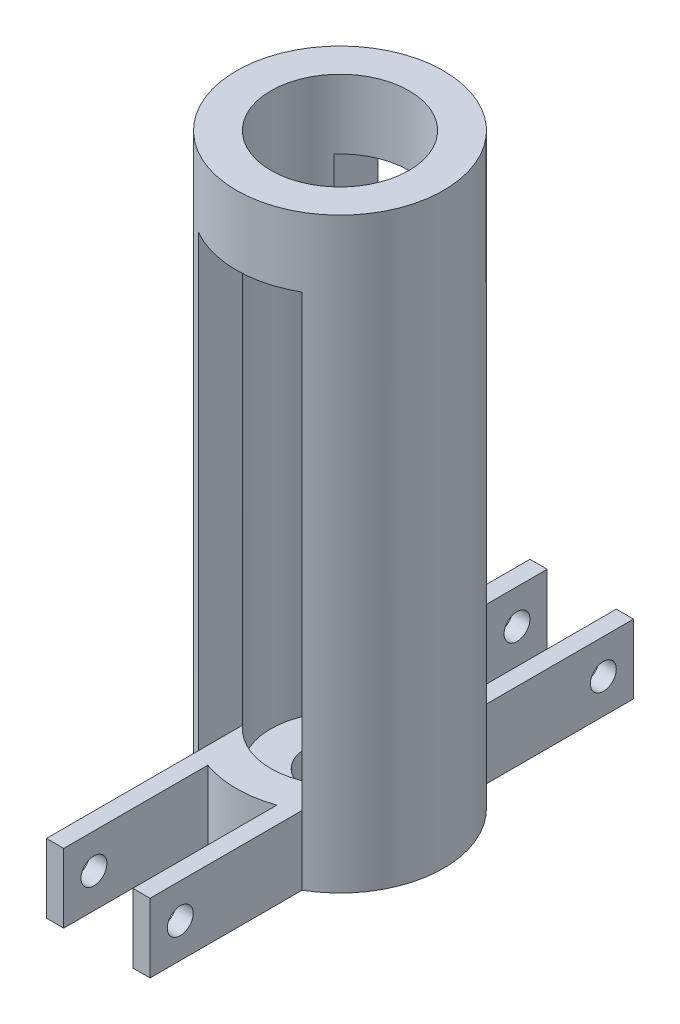
ISO-10303-21;
HEADER;
FILE_DESCRIPTION(('STEP AP214'),'2;1');
FILE_NAME('part.step','',(''),(''),'','','');
FILE_SCHEMA(('AUTOMOTIVE_DESIGN { 1 0 10303 214 1 1 1 1 }'));
ENDSEC;
DATA;
#1=APPLICATION_CONTEXT('core data for automotive mechanical design processes');
#2=APPLICATION_PROTOCOL_DEFINITION('international standard','automotive_design',2000,#1);
#3=PRODUCT_CONTEXT('',#1,'mechanical');
#4=PRODUCT('Part','Part','',(#3));
#5=PRODUCT_RELATED_PRODUCT_CATEGORY('part','',(#4));
#6=PRODUCT_DEFINITION_FORMATION('','',#4);
#7=PRODUCT_DEFINITION_CONTEXT('part definition',#1,'design');
#8=PRODUCT_DEFINITION('design','',#6,#7);
#9=PRODUCT_DEFINITION_SHAPE('','',#8);
#10=(LENGTH_UNIT() NAMED_UNIT(*) SI_UNIT(.MILLI.,.METRE.));
#11=(NAMED_UNIT(*) PLANE_ANGLE_UNIT() SI_UNIT($,.RADIAN.));
#12=(NAMED_UNIT(*) SI_UNIT($,.STERADIAN.) SOLID_ANGLE_UNIT());
#13=UNCERTAINTY_MEASURE_WITH_UNIT(LENGTH_MEASURE(1.E-05),#10,'distance_accuracy_value','');
#14=(GEOMETRIC_REPRESENTATION_CONTEXT(3) GLOBAL_UNCERTAINTY_ASSIGNED_CONTEXT((#13)) GLOBAL_UNIT_ASSIGNED_CONTEXT((#10,
#11,#12)) REPRESENTATION_CONTEXT('',''));
#15=CARTESIAN_POINT('',(0.,0.,0.));
#16=DIRECTION('',(0.,0.,1.));
#17=DIRECTION('',(1.,0.,0.));
#18=AXIS2_PLACEMENT_3D('',#15,#16,#17);
#19=CARTESIAN_POINT('',(0.,107.95,0.));
#20=DIRECTION('',(0.,-1.,0.));
#21=DIRECTION('',(0.,0.,-1.));
#22=AXIS2_PLACEMENT_3D('',#19,#20,#21);
#23=CYLINDRICAL_SURFACE('',#22,19.05);
#24=CARTESIAN_POINT('',(0.,107.95,0.));
#25=DIRECTION('',(0.,1.,0.));
#26=DIRECTION('',(0.,0.,1.));
#27=AXIS2_PLACEMENT_3D('',#24,#25,#26);
#28=CIRCLE('',#27,19.05);
#29=CARTESIAN_POINT('',(0.,107.95,19.05));
#30=VERTEX_POINT('',#29);
#31=EDGE_CURVE('E344',#30,#30,#28,.T.);
#32=ORIENTED_EDGE('',*,*,#31,.F.);
#33=EDGE_LOOP('',(#32));
#34=FACE_BOUND('',#33,.T.);
#35=DIRECTION('',(0.,-1.,0.));
#36=VECTOR('',#35,1.);
#37=CARTESIAN_POINT('',(-9.52500000000001,107.95,-16.4977839420935));
#38=LINE('',#37,#36);
#39=CARTESIAN_POINT('',(-9.52500000000001,12.7,-16.4977839420935));
#40=VERTEX_POINT('',#39);
#41=CARTESIAN_POINT('',(-9.52500000000001,95.25,-16.4977839420935));
#42=VERTEX_POINT('',#41);
#43=EDGE_CURVE('E44',#40,#42,#38,.F.);
#44=ORIENTED_EDGE('',*,*,#43,.F.);
#45=DIRECTION('',(0.,1.,0.));
#46=VECTOR('',#45,1.);
#47=CARTESIAN_POINT('',(-9.52500000000001,0.,-16.4977839420936));
#48=LINE('',#47,#46);
#49=CARTESIAN_POINT('',(-9.52500000000001,0.,-16.4977839420936));
#50=VERTEX_POINT('',#49);
#51=EDGE_CURVE('E220',#50,#40,#48,.T.);
#52=ORIENTED_EDGE('',*,*,#51,.F.);
#53=CARTESIAN_POINT('',(0.,0.,0.));
#54=DIRECTION('',(0.,1.,0.));
#55=DIRECTION('',(0.,0.,1.));
#56=AXIS2_PLACEMENT_3D('',#53,#54,#55);
#57=CIRCLE('',#56,19.05);
#58=CARTESIAN_POINT('',(-9.525,0.,16.4977839420936));
#59=VERTEX_POINT('',#58);
#60=EDGE_CURVE('E343',#50,#59,#57,.T.);
#61=ORIENTED_EDGE('',*,*,#60,.T.);
#62=DIRECTION('',(0.,1.,0.));
#63=VECTOR('',#62,1.);
#64=CARTESIAN_POINT('',(-9.525,0.,16.4977839420936));
#65=LINE('',#64,#63);
#66=CARTESIAN_POINT('',(-9.525,12.7,16.4977839420936));
#67=VERTEX_POINT('',#66);
#68=EDGE_CURVE('E289',#59,#67,#65,.T.);
#69=ORIENTED_EDGE('',*,*,#68,.T.);
#70=DIRECTION('',(0.,-1.,0.));
#71=VECTOR('',#70,1.);
#72=CARTESIAN_POINT('',(-9.52500000000001,107.95,16.4977839420935));
#73=LINE('',#72,#71);
#74=CARTESIAN_POINT('',(-9.52500000000001,95.25,16.4977839420935));
#75=VERTEX_POINT('',#74);
#76=EDGE_CURVE('E360',#75,#67,#73,.T.);
#77=ORIENTED_EDGE('',*,*,#76,.F.);
#78=CARTESIAN_POINT('',(0.,95.25,0.));
#79=DIRECTION('',(0.,1.,0.));
#80=DIRECTION('',(0.,0.,1.));
#81=AXIS2_PLACEMENT_3D('',#78,#79,#80);
#82=CIRCLE('',#81,19.05);
#83=CARTESIAN_POINT('',(9.52499999999999,95.25,16.4977839420936));
#84=VERTEX_POINT('',#83);
#85=EDGE_CURVE('E358',#75,#84,#82,.T.);
#86=ORIENTED_EDGE('',*,*,#85,.T.);
#87=DIRECTION('',(0.,-1.,0.));
#88=VECTOR('',#87,1.);
#89=CARTESIAN_POINT('',(9.52499999999998,107.95,16.4977839420936));
#90=LINE('',#89,#88);
#91=CARTESIAN_POINT('',(9.52500000000001,12.7,16.4977839420935));
#92=VERTEX_POINT('',#91);
#93=EDGE_CURVE('E355',#84,#92,#90,.T.);
#94=ORIENTED_EDGE('',*,*,#93,.T.);
#95=DIRECTION('',(0.,1.,0.));
#96=VECTOR('',#95,1.);
#97=CARTESIAN_POINT('',(9.525,0.,16.4977839420936));
#98=LINE('',#97,#96);
#99=CARTESIAN_POINT('',(9.525,0.,16.4977839420936));
#100=VERTEX_POINT('',#99);
#101=EDGE_CURVE('E265',#100,#92,#98,.T.);
#102=ORIENTED_EDGE('',*,*,#101,.F.);
#103=CARTESIAN_POINT('',(9.525,0.,-16.4977839420936));
#104=VERTEX_POINT('',#103);
#105=EDGE_CURVE('E351',#100,#104,#57,.T.);
#106=ORIENTED_EDGE('',*,*,#105,.T.);
#107=DIRECTION('',(0.,1.,0.));
#108=VECTOR('',#107,1.);
#109=CARTESIAN_POINT('',(9.525,0.,-16.4977839420936));
#110=LINE('',#109,#108);
#111=CARTESIAN_POINT('',(9.525,12.7,-16.4977839420936));
#112=VERTEX_POINT('',#111);
#113=EDGE_CURVE('E240',#104,#112,#110,.T.);
#114=ORIENTED_EDGE('',*,*,#113,.T.);
#115=DIRECTION('',(0.,-1.,0.));
#116=VECTOR('',#115,1.);
#117=CARTESIAN_POINT('',(9.52499999999998,107.95,-16.4977839420936));
#118=LINE('',#117,#116);
#119=CARTESIAN_POINT('',(9.52499999999999,95.25,-16.4977839420936));
#120=VERTEX_POINT('',#119);
#121=EDGE_CURVE('E11',#112,#120,#118,.F.);
#122=ORIENTED_EDGE('',*,*,#121,.T.);
#123=EDGE_CURVE('E361',#120,#42,#82,.T.);
#124=ORIENTED_EDGE('',*,*,#123,.T.);
#125=EDGE_LOOP('',(#44,#52,#61,#69,#77,#86,#94,#102,#106,#114,#122,#124));
#126=FACE_BOUND('',#125,.T.);
#127=ADVANCED_FACE('F35',(#34,#126),#23,.T.);
#128=CARTESIAN_POINT('',(-6.35,0.,17.9605122421383));
#129=VERTEX_POINT('',#128);
#130=CARTESIAN_POINT('',(6.35,0.,17.9605122421383));
#131=VERTEX_POINT('',#130);
#132=EDGE_CURVE('E348',#129,#131,#57,.T.);
#133=ORIENTED_EDGE('',*,*,#132,.T.);
#134=DIRECTION('',(0.,-1.,0.));
#135=VECTOR('',#134,1.);
#136=CARTESIAN_POINT('',(6.35,107.95,17.9605122421383));
#137=LINE('',#136,#135);
#138=CARTESIAN_POINT('',(6.35,12.7,17.9605122421383));
#139=VERTEX_POINT('',#138);
#140=EDGE_CURVE('E268',#131,#139,#137,.F.);
#141=ORIENTED_EDGE('',*,*,#140,.T.);
#142=CARTESIAN_POINT('',(0.,12.7,0.));
#143=DIRECTION('',(0.,1.,0.));
#144=DIRECTION('',(-1.,0.,0.));
#145=AXIS2_PLACEMENT_3D('',#142,#143,#144);
#146=CIRCLE('',#145,19.05);
#147=CARTESIAN_POINT('',(-6.35,12.7,17.9605122421383));
#148=VERTEX_POINT('',#147);
#149=EDGE_CURVE('E347',#148,#139,#146,.T.);
#150=ORIENTED_EDGE('',*,*,#149,.F.);
#151=DIRECTION('',(0.,-1.,0.));
#152=VECTOR('',#151,1.);
#153=CARTESIAN_POINT('',(-6.35,107.95,17.9605122421383));
#154=LINE('',#153,#152);
#155=EDGE_CURVE('E292',#148,#129,#154,.T.);
#156=ORIENTED_EDGE('',*,*,#155,.T.);
#157=EDGE_LOOP('',(#133,#141,#150,#156));
#158=FACE_BOUND('',#157,.T.);
#159=ADVANCED_FACE('F419',(#158),#23,.T.);
#160=CARTESIAN_POINT('',(0.,107.95,0.));
#161=DIRECTION('',(0.,-1.,0.));
#162=DIRECTION('',(0.,0.,-1.));
#163=AXIS2_PLACEMENT_3D('',#160,#161,#162);
#164=CYLINDRICAL_SURFACE('',#163,12.7);
#165=CARTESIAN_POINT('',(0.,107.95,0.));
#166=DIRECTION('',(0.,1.,0.));
#167=DIRECTION('',(0.,0.,1.));
#168=AXIS2_PLACEMENT_3D('',#165,#166,#167);
#169=CIRCLE('',#168,12.7);
#170=CARTESIAN_POINT('',(0.,107.95,12.7));
#171=VERTEX_POINT('',#170);
#172=EDGE_CURVE('E340',#171,#171,#169,.T.);
#173=ORIENTED_EDGE('',*,*,#172,.T.);
#174=EDGE_LOOP('',(#173));
#175=FACE_BOUND('',#174,.T.);
#176=CARTESIAN_POINT('',(0.,6.34999999999999,0.));
#177=DIRECTION('',(0.,-1.,0.));
#178=DIRECTION('',(0.,0.,-1.));
#179=AXIS2_PLACEMENT_3D('',#176,#177,#178);
#180=CIRCLE('',#179,12.7);
#181=CARTESIAN_POINT('',(0.,6.34999999999999,-12.7));
#182=VERTEX_POINT('',#181);
#183=EDGE_CURVE('E339',#182,#182,#180,.T.);
#184=ORIENTED_EDGE('',*,*,#183,.T.);
#185=EDGE_LOOP('',(#184));
#186=FACE_BOUND('',#185,.T.);
#187=CARTESIAN_POINT('',(0.,12.7,0.));
#188=DIRECTION('',(0.,1.,0.));
#189=DIRECTION('',(-1.,0.,0.));
#190=AXIS2_PLACEMENT_3D('',#187,#188,#189);
#191=CIRCLE('',#190,12.7);
#192=CARTESIAN_POINT('',(9.52500000000001,12.7,-8.40026041263006));
#193=VERTEX_POINT('',#192);
#194=CARTESIAN_POINT('',(-9.52500000000001,12.7,-8.40026041263006));
#195=VERTEX_POINT('',#194);
#196=EDGE_CURVE('E321',#193,#195,#191,.T.);
#197=ORIENTED_EDGE('',*,*,#196,.T.);
#198=DIRECTION('',(0.,-1.,0.));
#199=VECTOR('',#198,1.);
#200=CARTESIAN_POINT('',(-9.52500000000001,107.95,-8.40026041263006));
#201=LINE('',#200,#199);
#202=CARTESIAN_POINT('',(-9.52500000000001,95.25,-8.40026041263006));
#203=VERTEX_POINT('',#202);
#204=EDGE_CURVE('E333',#195,#203,#201,.F.);
#205=ORIENTED_EDGE('',*,*,#204,.T.);
#206=CARTESIAN_POINT('',(0.,95.25,0.));
#207=DIRECTION('',(0.,1.,0.));
#208=DIRECTION('',(0.,0.,1.));
#209=AXIS2_PLACEMENT_3D('',#206,#207,#208);
#210=CIRCLE('',#209,12.7);
#211=CARTESIAN_POINT('',(9.52499999999999,95.25,-8.4002604126301));
#212=VERTEX_POINT('',#211);
#213=EDGE_CURVE('E332',#212,#203,#210,.T.);
#214=ORIENTED_EDGE('',*,*,#213,.F.);
#215=DIRECTION('',(0.,-1.,0.));
#216=VECTOR('',#215,1.);
#217=CARTESIAN_POINT('',(9.52499999999998,107.95,-8.40026041263009));
#218=LINE('',#217,#216);
#219=EDGE_CURVE('E325',#193,#212,#218,.F.);
#220=ORIENTED_EDGE('',*,*,#219,.F.);
#221=EDGE_LOOP('',(#197,#205,#214,#220));
#222=FACE_BOUND('',#221,.T.);
#223=CARTESIAN_POINT('',(-9.52500000000001,95.25,8.40026041263006));
#224=VERTEX_POINT('',#223);
#225=CARTESIAN_POINT('',(9.52499999999999,95.25,8.40026041263009));
#226=VERTEX_POINT('',#225);
#227=EDGE_CURVE('E330',#224,#226,#210,.T.);
#228=ORIENTED_EDGE('',*,*,#227,.F.);
#229=DIRECTION('',(0.,-1.,0.));
#230=VECTOR('',#229,1.);
#231=CARTESIAN_POINT('',(-9.52500000000001,107.95,8.40026041263006));
#232=LINE('',#231,#230);
#233=CARTESIAN_POINT('',(-9.52500000000001,12.7,8.40026041263006));
#234=VERTEX_POINT('',#233);
#235=EDGE_CURVE('E336',#224,#234,#232,.T.);
#236=ORIENTED_EDGE('',*,*,#235,.T.);
#237=CARTESIAN_POINT('',(9.52500000000001,12.7,8.40026041263006));
#238=VERTEX_POINT('',#237);
#239=EDGE_CURVE('E324',#234,#238,#191,.T.);
#240=ORIENTED_EDGE('',*,*,#239,.T.);
#241=DIRECTION('',(0.,-1.,0.));
#242=VECTOR('',#241,1.);
#243=CARTESIAN_POINT('',(9.52499999999998,107.95,8.40026041263009));
#244=LINE('',#243,#242);
#245=EDGE_CURVE('E327',#226,#238,#244,.T.);
#246=ORIENTED_EDGE('',*,*,#245,.F.);
#247=EDGE_LOOP('',(#228,#236,#240,#246));
#248=FACE_BOUND('',#247,.T.);
#249=ADVANCED_FACE('F384',(#175,#186,#222,#248),#164,.F.);
#250=CARTESIAN_POINT('',(6.35,0.,-17.9605122421383));
#251=VERTEX_POINT('',#250);
#252=CARTESIAN_POINT('',(-6.35000000000001,0.,-17.9605122421383));
#253=VERTEX_POINT('',#252);
#254=EDGE_CURVE('E398',#251,#253,#57,.T.);
#255=ORIENTED_EDGE('',*,*,#254,.T.);
#256=DIRECTION('',(0.,-1.,0.));
#257=VECTOR('',#256,1.);
#258=CARTESIAN_POINT('',(-6.35000000000001,107.95,-17.9605122421383));
#259=LINE('',#258,#257);
#260=CARTESIAN_POINT('',(-6.35000000000001,12.7,-17.9605122421383));
#261=VERTEX_POINT('',#260);
#262=EDGE_CURVE('E223',#253,#261,#259,.F.);
#263=ORIENTED_EDGE('',*,*,#262,.T.);
#264=CARTESIAN_POINT('',(6.35,12.7,-17.9605122421383));
#265=VERTEX_POINT('',#264);
#266=EDGE_CURVE('E194',#265,#261,#146,.T.);
#267=ORIENTED_EDGE('',*,*,#266,.F.);
#268=DIRECTION('',(0.,-1.,0.));
#269=VECTOR('',#268,1.);
#270=CARTESIAN_POINT('',(6.35,107.95,-17.9605122421383));
#271=LINE('',#270,#269);
#272=EDGE_CURVE('E243',#265,#251,#271,.T.);
#273=ORIENTED_EDGE('',*,*,#272,.T.);
#274=EDGE_LOOP('',(#255,#263,#267,#273));
#275=FACE_BOUND('',#274,.T.);
#276=ADVANCED_FACE('F37',(#275),#23,.T.);
#277=CARTESIAN_POINT('',(0.,107.95,0.));
#278=DIRECTION('',(0.,1.,0.));
#279=DIRECTION('',(0.,0.,1.));
#280=AXIS2_PLACEMENT_3D('',#277,#278,#279);
#281=PLANE('',#280);
#282=ORIENTED_EDGE('',*,*,#31,.T.);
#283=EDGE_LOOP('',(#282));
#284=FACE_BOUND('',#283,.T.);
#285=ORIENTED_EDGE('',*,*,#172,.F.);
#286=EDGE_LOOP('',(#285));
#287=FACE_BOUND('',#286,.T.);
#288=ADVANCED_FACE('F418',(#284,#287),#281,.T.);
#289=CARTESIAN_POINT('',(0.,0.,0.));
#290=DIRECTION('',(0.,1.,0.));
#291=DIRECTION('',(0.,0.,1.));
#292=AXIS2_PLACEMENT_3D('',#289,#290,#291);
#293=PLANE('',#292);
#294=ORIENTED_EDGE('',*,*,#60,.F.);
#295=DIRECTION('',(0.,0.,1.));
#296=VECTOR('',#295,1.);
#297=CARTESIAN_POINT('',(-9.52500000000001,0.,-16.4977839420936));
#298=LINE('',#297,#296);
#299=CARTESIAN_POINT('',(-9.52500000000002,0.,-44.45));
#300=VERTEX_POINT('',#299);
#301=EDGE_CURVE('E208',#300,#50,#298,.T.);
#302=ORIENTED_EDGE('',*,*,#301,.F.);
#303=DIRECTION('',(-1.,0.,0.));
#304=VECTOR('',#303,1.);
#305=CARTESIAN_POINT('',(-6.35000000000002,0.,-44.45));
#306=LINE('',#305,#304);
#307=CARTESIAN_POINT('',(-6.35000000000002,0.,-44.45));
#308=VERTEX_POINT('',#307);
#309=EDGE_CURVE('E217',#308,#300,#306,.T.);
#310=ORIENTED_EDGE('',*,*,#309,.F.);
#311=DIRECTION('',(0.,0.,-1.));
#312=VECTOR('',#311,1.);
#313=CARTESIAN_POINT('',(-6.35000000000001,0.,-16.4977839420936));
#314=LINE('',#313,#312);
#315=EDGE_CURVE('E203',#253,#308,#314,.T.);
#316=ORIENTED_EDGE('',*,*,#315,.F.);
#317=ORIENTED_EDGE('',*,*,#254,.F.);
#318=DIRECTION('',(0.,0.,1.));
#319=VECTOR('',#318,1.);
#320=CARTESIAN_POINT('',(6.35,0.,-16.4977839420936));
#321=LINE('',#320,#319);
#322=CARTESIAN_POINT('',(6.35,0.,-44.45));
#323=VERTEX_POINT('',#322);
#324=EDGE_CURVE('E238',#323,#251,#321,.T.);
#325=ORIENTED_EDGE('',*,*,#324,.F.);
#326=DIRECTION('',(-1.,0.,0.));
#327=VECTOR('',#326,1.);
#328=CARTESIAN_POINT('',(6.35,0.,-44.45));
#329=LINE('',#328,#327);
#330=CARTESIAN_POINT('',(9.525,0.,-44.45));
#331=VERTEX_POINT('',#330);
#332=EDGE_CURVE('E235',#331,#323,#329,.T.);
#333=ORIENTED_EDGE('',*,*,#332,.F.);
#334=DIRECTION('',(0.,0.,-1.));
#335=VECTOR('',#334,1.);
#336=CARTESIAN_POINT('',(9.525,0.,-16.4977839420936));
#337=LINE('',#336,#335);
#338=EDGE_CURVE('E232',#104,#331,#337,.T.);
#339=ORIENTED_EDGE('',*,*,#338,.F.);
#340=ORIENTED_EDGE('',*,*,#105,.F.);
#341=DIRECTION('',(0.,0.,-1.));
#342=VECTOR('',#341,1.);
#343=CARTESIAN_POINT('',(9.525,0.,16.4977839420936));
#344=LINE('',#343,#342);
#345=CARTESIAN_POINT('',(9.525,0.,44.45));
#346=VERTEX_POINT('',#345);
#347=EDGE_CURVE('E262',#346,#100,#344,.T.);
#348=ORIENTED_EDGE('',*,*,#347,.F.);
#349=DIRECTION('',(1.,0.,0.));
#350=VECTOR('',#349,1.);
#351=CARTESIAN_POINT('',(6.35,0.,44.45));
#352=LINE('',#351,#350);
#353=CARTESIAN_POINT('',(6.35,0.,44.45));
#354=VERTEX_POINT('',#353);
#355=EDGE_CURVE('E259',#354,#346,#352,.T.);
#356=ORIENTED_EDGE('',*,*,#355,.F.);
#357=DIRECTION('',(0.,0.,1.));
#358=VECTOR('',#357,1.);
#359=CARTESIAN_POINT('',(6.35,0.,16.4977839420936));
#360=LINE('',#359,#358);
#361=EDGE_CURVE('E257',#131,#354,#360,.T.);
#362=ORIENTED_EDGE('',*,*,#361,.F.);
#363=ORIENTED_EDGE('',*,*,#132,.F.);
#364=DIRECTION('',(0.,0.,-1.));
#365=VECTOR('',#364,1.);
#366=CARTESIAN_POINT('',(-6.35,0.,16.4977839420936));
#367=LINE('',#366,#365);
#368=CARTESIAN_POINT('',(-6.35,0.,44.45));
#369=VERTEX_POINT('',#368);
#370=EDGE_CURVE('E287',#369,#129,#367,.T.);
#371=ORIENTED_EDGE('',*,*,#370,.F.);
#372=DIRECTION('',(1.,0.,0.));
#373=VECTOR('',#372,1.);
#374=CARTESIAN_POINT('',(-6.35,0.,44.45));
#375=LINE('',#374,#373);
#376=CARTESIAN_POINT('',(-9.525,0.,44.45));
#377=VERTEX_POINT('',#376);
#378=EDGE_CURVE('E284',#377,#369,#375,.T.);
#379=ORIENTED_EDGE('',*,*,#378,.F.);
#380=DIRECTION('',(0.,0.,1.));
#381=VECTOR('',#380,1.);
#382=CARTESIAN_POINT('',(-9.525,0.,16.4977839420936));
#383=LINE('',#382,#381);
#384=EDGE_CURVE('E281',#59,#377,#383,.T.);
#385=ORIENTED_EDGE('',*,*,#384,.F.);
#386=EDGE_LOOP('',(#294,#302,#310,#316,#317,#325,#333,#339,#340,#348,#356,#362,#363,#371,#379,#385));
#387=FACE_BOUND('',#386,.T.);
#388=CARTESIAN_POINT('',(0.,0.,0.));
#389=DIRECTION('',(0.,1.,0.));
#390=DIRECTION('',(0.,0.,1.));
#391=AXIS2_PLACEMENT_3D('',#388,#389,#390);
#392=CIRCLE('',#391,6.35);
#393=CARTESIAN_POINT('',(0.,0.,6.35));
#394=VERTEX_POINT('',#393);
#395=EDGE_CURVE('E300',#394,#394,#392,.T.);
#396=ORIENTED_EDGE('',*,*,#395,.T.);
#397=EDGE_LOOP('',(#396));
#398=FACE_BOUND('',#397,.T.);
#399=ADVANCED_FACE('F395',(#387,#398),#293,.F.);
#400=CARTESIAN_POINT('',(0.,6.35,0.));
#401=DIRECTION('',(0.,-1.,0.));
#402=DIRECTION('',(0.,0.,-1.));
#403=AXIS2_PLACEMENT_3D('',#400,#401,#402);
#404=PLANE('',#403);
#405=CARTESIAN_POINT('',(0.,6.35,0.));
#406=DIRECTION('',(0.,1.,0.));
#407=DIRECTION('',(0.,0.,1.));
#408=AXIS2_PLACEMENT_3D('',#405,#406,#407);
#409=CIRCLE('',#408,6.35);
#410=CARTESIAN_POINT('',(0.,6.35,6.35));
#411=VERTEX_POINT('',#410);
#412=EDGE_CURVE('E299',#411,#411,#409,.T.);
#413=ORIENTED_EDGE('',*,*,#412,.F.);
#414=EDGE_LOOP('',(#413));
#415=FACE_BOUND('',#414,.T.);
#416=ORIENTED_EDGE('',*,*,#183,.F.);
#417=EDGE_LOOP('',(#416));
#418=FACE_BOUND('',#417,.T.);
#419=ADVANCED_FACE('F495',(#415,#418),#404,.F.);
#420=CARTESIAN_POINT('',(0.,12.7,-19.05));
#421=DIRECTION('',(0.,1.,0.));
#422=DIRECTION('',(-1.,0.,0.));
#423=AXIS2_PLACEMENT_3D('',#420,#421,#422);
#424=PLANE('',#423);
#425=ORIENTED_EDGE('',*,*,#266,.T.);
#426=DIRECTION('',(0.,0.,-1.));
#427=VECTOR('',#426,1.);
#428=CARTESIAN_POINT('',(-6.35000000000001,12.7,-16.4977839420936));
#429=LINE('',#428,#427);
#430=CARTESIAN_POINT('',(-6.35000000000002,12.7,-44.45));
#431=VERTEX_POINT('',#430);
#432=EDGE_CURVE('E187',#261,#431,#429,.T.);
#433=ORIENTED_EDGE('',*,*,#432,.T.);
#434=DIRECTION('',(-1.,0.,0.));
#435=VECTOR('',#434,1.);
#436=CARTESIAN_POINT('',(-6.35000000000002,12.7,-44.45));
#437=LINE('',#436,#435);
#438=CARTESIAN_POINT('',(-9.52500000000002,12.7,-44.45));
#439=VERTEX_POINT('',#438);
#440=EDGE_CURVE('E191',#431,#439,#437,.T.);
#441=ORIENTED_EDGE('',*,*,#440,.T.);
#442=DIRECTION('',(0.,0.,1.));
#443=VECTOR('',#442,1.);
#444=CARTESIAN_POINT('',(-9.52500000000001,12.7,-16.4977839420936));
#445=LINE('',#444,#443);
#446=EDGE_CURVE('E211',#439,#40,#445,.T.);
#447=ORIENTED_EDGE('',*,*,#446,.T.);
#448=DIRECTION('',(0.,0.,1.));
#449=VECTOR('',#448,1.);
#450=CARTESIAN_POINT('',(-9.52500000000001,12.7,-19.05));
#451=LINE('',#450,#449);
#452=EDGE_CURVE('E318',#40,#195,#451,.T.);
#453=ORIENTED_EDGE('',*,*,#452,.T.);
#454=ORIENTED_EDGE('',*,*,#196,.F.);
#455=DIRECTION('',(0.,0.,1.));
#456=VECTOR('',#455,1.);
#457=CARTESIAN_POINT('',(9.52500000000001,12.7,-19.05));
#458=LINE('',#457,#456);
#459=EDGE_CURVE('E314',#112,#193,#458,.T.);
#460=ORIENTED_EDGE('',*,*,#459,.F.);
#461=DIRECTION('',(0.,0.,-1.));
#462=VECTOR('',#461,1.);
#463=CARTESIAN_POINT('',(9.525,12.7,-16.4977839420936));
#464=LINE('',#463,#462);
#465=CARTESIAN_POINT('',(9.525,12.7,-44.45));
#466=VERTEX_POINT('',#465);
#467=EDGE_CURVE('E226',#112,#466,#464,.T.);
#468=ORIENTED_EDGE('',*,*,#467,.T.);
#469=DIRECTION('',(-1.,0.,0.));
#470=VECTOR('',#469,1.);
#471=CARTESIAN_POINT('',(6.35,12.7,-44.45));
#472=LINE('',#471,#470);
#473=CARTESIAN_POINT('',(6.35,12.7,-44.45));
#474=VERTEX_POINT('',#473);
#475=EDGE_CURVE('E229',#466,#474,#472,.T.);
#476=ORIENTED_EDGE('',*,*,#475,.T.);
#477=DIRECTION('',(0.,0.,1.));
#478=VECTOR('',#477,1.);
#479=CARTESIAN_POINT('',(6.35,12.7,-16.4977839420936));
#480=LINE('',#479,#478);
#481=EDGE_CURVE('E51',#474,#265,#480,.T.);
#482=ORIENTED_EDGE('',*,*,#481,.T.);
#483=EDGE_LOOP('',(#425,#433,#441,#447,#453,#454,#460,#468,#476,#482));
#484=FACE_BOUND('',#483,.T.);
#485=ADVANCED_FACE('F189',(#484),#424,.T.);
#486=CARTESIAN_POINT('',(9.52500000000001,0.,-19.05));
#487=DIRECTION('',(1.,0.,0.));
#488=DIRECTION('',(0.,1.,0.));
#489=AXIS2_PLACEMENT_3D('',#486,#487,#488);
#490=PLANE('',#489);
#491=ORIENTED_EDGE('',*,*,#219,.T.);
#492=DIRECTION('',(0.,0.,1.));
#493=VECTOR('',#492,1.);
#494=CARTESIAN_POINT('',(9.52499999999999,95.25,-19.05));
#495=LINE('',#494,#493);
#496=EDGE_CURVE('E310',#120,#212,#495,.T.);
#497=ORIENTED_EDGE('',*,*,#496,.F.);
#498=ORIENTED_EDGE('',*,*,#121,.F.);
#499=ORIENTED_EDGE('',*,*,#459,.T.);
#500=EDGE_LOOP('',(#491,#497,#498,#499));
#501=FACE_BOUND('',#500,.T.);
#502=ADVANCED_FACE('F379',(#501),#490,.F.);
#503=CARTESIAN_POINT('',(0.,95.25,-19.05));
#504=DIRECTION('',(0.,1.,0.));
#505=DIRECTION('',(0.,0.,1.));
#506=AXIS2_PLACEMENT_3D('',#503,#504,#505);
#507=PLANE('',#506);
#508=ORIENTED_EDGE('',*,*,#213,.T.);
#509=DIRECTION('',(0.,0.,1.));
#510=VECTOR('',#509,1.);
#511=CARTESIAN_POINT('',(-9.52500000000001,95.25,-19.05));
#512=LINE('',#511,#510);
#513=EDGE_CURVE('E309',#42,#203,#512,.T.);
#514=ORIENTED_EDGE('',*,*,#513,.F.);
#515=ORIENTED_EDGE('',*,*,#123,.F.);
#516=ORIENTED_EDGE('',*,*,#496,.T.);
#517=EDGE_LOOP('',(#508,#514,#515,#516));
#518=FACE_BOUND('',#517,.T.);
#519=ADVANCED_FACE('F376',(#518),#507,.F.);
#520=CARTESIAN_POINT('',(-9.52500000000001,0.,-19.05));
#521=DIRECTION('',(1.,0.,0.));
#522=DIRECTION('',(0.,0.,-1.));
#523=AXIS2_PLACEMENT_3D('',#520,#521,#522);
#524=PLANE('',#523);
#525=ORIENTED_EDGE('',*,*,#452,.F.);
#526=ORIENTED_EDGE('',*,*,#43,.T.);
#527=ORIENTED_EDGE('',*,*,#513,.T.);
#528=ORIENTED_EDGE('',*,*,#204,.F.);
#529=EDGE_LOOP('',(#525,#526,#527,#528));
#530=FACE_BOUND('',#529,.T.);
#531=ADVANCED_FACE('F387',(#530),#524,.T.);
#532=EDGE_CURVE('E306',#224,#75,#512,.T.);
#533=ORIENTED_EDGE('',*,*,#532,.T.);
#534=ORIENTED_EDGE('',*,*,#76,.T.);
#535=EDGE_CURVE('E303',#234,#67,#451,.T.);
#536=ORIENTED_EDGE('',*,*,#535,.F.);
#537=ORIENTED_EDGE('',*,*,#235,.F.);
#538=EDGE_LOOP('',(#533,#534,#536,#537));
#539=FACE_BOUND('',#538,.T.);
#540=ADVANCED_FACE('F460',(#539),#524,.T.);
#541=ORIENTED_EDGE('',*,*,#227,.T.);
#542=EDGE_CURVE('E311',#226,#84,#495,.T.);
#543=ORIENTED_EDGE('',*,*,#542,.T.);
#544=ORIENTED_EDGE('',*,*,#85,.F.);
#545=ORIENTED_EDGE('',*,*,#532,.F.);
#546=EDGE_LOOP('',(#541,#543,#544,#545));
#547=FACE_BOUND('',#546,.T.);
#548=ADVANCED_FACE('F457',(#547),#507,.F.);
#549=ORIENTED_EDGE('',*,*,#245,.T.);
#550=EDGE_CURVE('E315',#238,#92,#458,.T.);
#551=ORIENTED_EDGE('',*,*,#550,.T.);
#552=ORIENTED_EDGE('',*,*,#93,.F.);
#553=ORIENTED_EDGE('',*,*,#542,.F.);
#554=EDGE_LOOP('',(#549,#551,#552,#553));
#555=FACE_BOUND('',#554,.T.);
#556=ADVANCED_FACE('F450',(#555),#490,.F.);
#557=ORIENTED_EDGE('',*,*,#149,.T.);
#558=DIRECTION('',(0.,0.,1.));
#559=VECTOR('',#558,1.);
#560=CARTESIAN_POINT('',(6.35,12.7,16.4977839420936));
#561=LINE('',#560,#559);
#562=CARTESIAN_POINT('',(6.35,12.7,44.45));
#563=VERTEX_POINT('',#562);
#564=EDGE_CURVE('E250',#139,#563,#561,.T.);
#565=ORIENTED_EDGE('',*,*,#564,.T.);
#566=DIRECTION('',(1.,0.,0.));
#567=VECTOR('',#566,1.);
#568=CARTESIAN_POINT('',(6.35,12.7,44.45));
#569=LINE('',#568,#567);
#570=CARTESIAN_POINT('',(9.525,12.7,44.45));
#571=VERTEX_POINT('',#570);
#572=EDGE_CURVE('E252',#563,#571,#569,.T.);
#573=ORIENTED_EDGE('',*,*,#572,.T.);
#574=DIRECTION('',(0.,0.,-1.));
#575=VECTOR('',#574,1.);
#576=CARTESIAN_POINT('',(9.525,12.7,16.4977839420936));
#577=LINE('',#576,#575);
#578=EDGE_CURVE('E255',#571,#92,#577,.T.);
#579=ORIENTED_EDGE('',*,*,#578,.T.);
#580=ORIENTED_EDGE('',*,*,#550,.F.);
#581=ORIENTED_EDGE('',*,*,#239,.F.);
#582=ORIENTED_EDGE('',*,*,#535,.T.);
#583=DIRECTION('',(0.,0.,1.));
#584=VECTOR('',#583,1.);
#585=CARTESIAN_POINT('',(-9.525,12.7,16.4977839420936));
#586=LINE('',#585,#584);
#587=CARTESIAN_POINT('',(-9.525,12.7,44.45));
#588=VERTEX_POINT('',#587);
#589=EDGE_CURVE('E275',#67,#588,#586,.T.);
#590=ORIENTED_EDGE('',*,*,#589,.T.);
#591=DIRECTION('',(1.,0.,0.));
#592=VECTOR('',#591,1.);
#593=CARTESIAN_POINT('',(-6.35,12.7,44.45));
#594=LINE('',#593,#592);
#595=CARTESIAN_POINT('',(-6.35,12.7,44.45));
#596=VERTEX_POINT('',#595);
#597=EDGE_CURVE('E278',#588,#596,#594,.T.);
#598=ORIENTED_EDGE('',*,*,#597,.T.);
#599=DIRECTION('',(0.,0.,-1.));
#600=VECTOR('',#599,1.);
#601=CARTESIAN_POINT('',(-6.35,12.7,16.4977839420936));
#602=LINE('',#601,#600);
#603=EDGE_CURVE('E59',#596,#148,#602,.T.);
#604=ORIENTED_EDGE('',*,*,#603,.T.);
#605=EDGE_LOOP('',(#557,#565,#573,#579,#580,#581,#582,#590,#598,#604));
#606=FACE_BOUND('',#605,.T.);
#607=ADVANCED_FACE('F445',(#606),#424,.T.);
#608=CARTESIAN_POINT('',(0.,0.,0.));
#609=DIRECTION('',(0.,1.,0.));
#610=DIRECTION('',(0.,0.,1.));
#611=AXIS2_PLACEMENT_3D('',#608,#609,#610);
#612=CYLINDRICAL_SURFACE('',#611,6.35);
#613=ORIENTED_EDGE('',*,*,#395,.F.);
#614=EDGE_LOOP('',(#613));
#615=FACE_BOUND('',#614,.T.);
#616=ORIENTED_EDGE('',*,*,#412,.T.);
#617=EDGE_LOOP('',(#616));
#618=FACE_BOUND('',#617,.T.);
#619=ADVANCED_FACE('F469',(#615,#618),#612,.F.);
#620=CARTESIAN_POINT('',(-6.35,0.,16.4977839420936));
#621=DIRECTION('',(1.,0.,0.));
#622=DIRECTION('',(0.,0.,-1.));
#623=AXIS2_PLACEMENT_3D('',#620,#621,#622);
#624=PLANE('',#623);
#625=CARTESIAN_POINT('',(-6.35,6.35,38.89375));
#626=DIRECTION('',(1.,0.,0.));
#627=DIRECTION('',(0.,0.,-1.));
#628=AXIS2_PLACEMENT_3D('',#625,#626,#627);
#629=CIRCLE('',#628,2.38125);
#630=CARTESIAN_POINT('',(-6.35,6.35,36.5125));
#631=VERTEX_POINT('',#630);
#632=EDGE_CURVE('E197',#631,#631,#629,.T.);
#633=ORIENTED_EDGE('',*,*,#632,.F.);
#634=EDGE_LOOP('',(#633));
#635=FACE_BOUND('',#634,.T.);
#636=ORIENTED_EDGE('',*,*,#155,.F.);
#637=ORIENTED_EDGE('',*,*,#603,.F.);
#638=DIRECTION('',(0.,1.,0.));
#639=VECTOR('',#638,1.);
#640=CARTESIAN_POINT('',(-6.35,0.,44.45));
#641=LINE('',#640,#639);
#642=EDGE_CURVE('E290',#369,#596,#641,.T.);
#643=ORIENTED_EDGE('',*,*,#642,.F.);
#644=ORIENTED_EDGE('',*,*,#370,.T.);
#645=EDGE_LOOP('',(#636,#637,#643,#644));
#646=FACE_BOUND('',#645,.T.);
#647=ADVANCED_FACE('F467',(#635,#646),#624,.T.);
#648=CARTESIAN_POINT('',(-6.35,0.,44.45));
#649=DIRECTION('',(0.,0.,1.));
#650=DIRECTION('',(1.,0.,0.));
#651=AXIS2_PLACEMENT_3D('',#648,#649,#650);
#652=PLANE('',#651);
#653=ORIENTED_EDGE('',*,*,#642,.T.);
#654=ORIENTED_EDGE('',*,*,#597,.F.);
#655=DIRECTION('',(0.,1.,0.));
#656=VECTOR('',#655,1.);
#657=CARTESIAN_POINT('',(-9.525,0.,44.45));
#658=LINE('',#657,#656);
#659=EDGE_CURVE('E293',#377,#588,#658,.T.);
#660=ORIENTED_EDGE('',*,*,#659,.F.);
#661=ORIENTED_EDGE('',*,*,#378,.T.);
#662=EDGE_LOOP('',(#653,#654,#660,#661));
#663=FACE_BOUND('',#662,.T.);
#664=ADVANCED_FACE('F465',(#663),#652,.T.);
#665=CARTESIAN_POINT('',(-9.525,0.,16.4977839420936));
#666=DIRECTION('',(-1.,0.,0.));
#667=DIRECTION('',(0.,0.,1.));
#668=AXIS2_PLACEMENT_3D('',#665,#666,#667);
#669=PLANE('',#668);
#670=CARTESIAN_POINT('',(-9.52500000000001,6.35,38.89375));
#671=DIRECTION('',(-1.,0.,0.));
#672=DIRECTION('',(0.,0.,-1.));
#673=AXIS2_PLACEMENT_3D('',#670,#671,#672);
#674=CIRCLE('',#673,2.38125);
#675=CARTESIAN_POINT('',(-9.52500000000001,6.35,36.5125));
#676=VERTEX_POINT('',#675);
#677=EDGE_CURVE('E736',#676,#676,#674,.T.);
#678=ORIENTED_EDGE('',*,*,#677,.F.);
#679=EDGE_LOOP('',(#678));
#680=FACE_BOUND('',#679,.T.);
#681=ORIENTED_EDGE('',*,*,#659,.T.);
#682=ORIENTED_EDGE('',*,*,#589,.F.);
#683=ORIENTED_EDGE('',*,*,#68,.F.);
#684=ORIENTED_EDGE('',*,*,#384,.T.);
#685=EDGE_LOOP('',(#681,#682,#683,#684));
#686=FACE_BOUND('',#685,.T.);
#687=ADVANCED_FACE('F476',(#680,#686),#669,.T.);
#688=CARTESIAN_POINT('',(6.35,0.,16.4977839420936));
#689=DIRECTION('',(-1.,0.,0.));
#690=DIRECTION('',(0.,0.,1.));
#691=AXIS2_PLACEMENT_3D('',#688,#689,#690);
#692=PLANE('',#691);
#693=CARTESIAN_POINT('',(6.35,6.35,38.89375));
#694=DIRECTION('',(-1.,0.,0.));
#695=DIRECTION('',(0.,0.,1.));
#696=AXIS2_PLACEMENT_3D('',#693,#694,#695);
#697=CIRCLE('',#696,2.38125);
#698=CARTESIAN_POINT('',(6.35,6.35,41.275));
#699=VERTEX_POINT('',#698);
#700=EDGE_CURVE('E751',#699,#699,#697,.T.);
#701=ORIENTED_EDGE('',*,*,#700,.F.);
#702=EDGE_LOOP('',(#701));
#703=FACE_BOUND('',#702,.T.);
#704=ORIENTED_EDGE('',*,*,#140,.F.);
#705=ORIENTED_EDGE('',*,*,#361,.T.);
#706=DIRECTION('',(0.,1.,0.));
#707=VECTOR('',#706,1.);
#708=CARTESIAN_POINT('',(6.35,0.,44.45));
#709=LINE('',#708,#707);
#710=EDGE_CURVE('E264',#354,#563,#709,.T.);
#711=ORIENTED_EDGE('',*,*,#710,.T.);
#712=ORIENTED_EDGE('',*,*,#564,.F.);
#713=EDGE_LOOP('',(#704,#705,#711,#712));
#714=FACE_BOUND('',#713,.T.);
#715=ADVANCED_FACE('F440',(#703,#714),#692,.T.);
#716=CARTESIAN_POINT('',(9.525,0.,16.4977839420936));
#717=DIRECTION('',(1.,0.,0.));
#718=DIRECTION('',(0.,0.,-1.));
#719=AXIS2_PLACEMENT_3D('',#716,#717,#718);
#720=PLANE('',#719);
#721=CARTESIAN_POINT('',(9.525,6.35,38.89375));
#722=DIRECTION('',(1.,0.,0.));
#723=DIRECTION('',(0.,0.,-1.));
#724=AXIS2_PLACEMENT_3D('',#721,#722,#723);
#725=CIRCLE('',#724,2.38125);
#726=CARTESIAN_POINT('',(9.525,6.35,36.5125));
#727=VERTEX_POINT('',#726);
#728=EDGE_CURVE('E39',#727,#727,#725,.T.);
#729=ORIENTED_EDGE('',*,*,#728,.F.);
#730=EDGE_LOOP('',(#729));
#731=FACE_BOUND('',#730,.T.);
#732=ORIENTED_EDGE('',*,*,#101,.T.);
#733=ORIENTED_EDGE('',*,*,#578,.F.);
#734=DIRECTION('',(0.,1.,0.));
#735=VECTOR('',#734,1.);
#736=CARTESIAN_POINT('',(9.525,0.,44.45));
#737=LINE('',#736,#735);
#738=EDGE_CURVE('E269',#346,#571,#737,.T.);
#739=ORIENTED_EDGE('',*,*,#738,.F.);
#740=ORIENTED_EDGE('',*,*,#347,.T.);
#741=EDGE_LOOP('',(#732,#733,#739,#740));
#742=FACE_BOUND('',#741,.T.);
#743=ADVANCED_FACE('F447',(#731,#742),#720,.T.);
#744=CARTESIAN_POINT('',(6.35,0.,44.45));
#745=DIRECTION('',(0.,0.,1.));
#746=DIRECTION('',(1.,0.,0.));
#747=AXIS2_PLACEMENT_3D('',#744,#745,#746);
#748=PLANE('',#747);
#749=ORIENTED_EDGE('',*,*,#738,.T.);
#750=ORIENTED_EDGE('',*,*,#572,.F.);
#751=ORIENTED_EDGE('',*,*,#710,.F.);
#752=ORIENTED_EDGE('',*,*,#355,.T.);
#753=EDGE_LOOP('',(#749,#750,#751,#752));
#754=FACE_BOUND('',#753,.T.);
#755=ADVANCED_FACE('F443',(#754),#748,.T.);
#756=CARTESIAN_POINT('',(6.35,0.,-16.4977839420936));
#757=DIRECTION('',(-1.,0.,0.));
#758=DIRECTION('',(0.,0.,1.));
#759=AXIS2_PLACEMENT_3D('',#756,#757,#758);
#760=PLANE('',#759);
#761=CARTESIAN_POINT('',(6.35,6.35,-38.89375));
#762=DIRECTION('',(-1.,0.,0.));
#763=DIRECTION('',(0.,0.,1.));
#764=AXIS2_PLACEMENT_3D('',#761,#762,#763);
#765=CIRCLE('',#764,2.38125);
#766=CARTESIAN_POINT('',(6.35,6.35,-36.5125));
#767=VERTEX_POINT('',#766);
#768=EDGE_CURVE('E748',#767,#767,#765,.T.);
#769=ORIENTED_EDGE('',*,*,#768,.F.);
#770=EDGE_LOOP('',(#769));
#771=FACE_BOUND('',#770,.T.);
#772=ORIENTED_EDGE('',*,*,#272,.F.);
#773=ORIENTED_EDGE('',*,*,#481,.F.);
#774=DIRECTION('',(0.,1.,0.));
#775=VECTOR('',#774,1.);
#776=CARTESIAN_POINT('',(6.35,0.,-44.45));
#777=LINE('',#776,#775);
#778=EDGE_CURVE('E241',#323,#474,#777,.T.);
#779=ORIENTED_EDGE('',*,*,#778,.F.);
#780=ORIENTED_EDGE('',*,*,#324,.T.);
#781=EDGE_LOOP('',(#772,#773,#779,#780));
#782=FACE_BOUND('',#781,.T.);
#783=ADVANCED_FACE('F416',(#771,#782),#760,.T.);
#784=CARTESIAN_POINT('',(6.35,0.,-44.45));
#785=DIRECTION('',(0.,0.,-1.));
#786=DIRECTION('',(-1.,0.,0.));
#787=AXIS2_PLACEMENT_3D('',#784,#785,#786);
#788=PLANE('',#787);
#789=ORIENTED_EDGE('',*,*,#778,.T.);
#790=ORIENTED_EDGE('',*,*,#475,.F.);
#791=DIRECTION('',(0.,1.,0.));
#792=VECTOR('',#791,1.);
#793=CARTESIAN_POINT('',(9.525,0.,-44.45));
#794=LINE('',#793,#792);
#795=EDGE_CURVE('E244',#331,#466,#794,.T.);
#796=ORIENTED_EDGE('',*,*,#795,.F.);
#797=ORIENTED_EDGE('',*,*,#332,.T.);
#798=EDGE_LOOP('',(#789,#790,#796,#797));
#799=FACE_BOUND('',#798,.T.);
#800=ADVANCED_FACE('F414',(#799),#788,.T.);
#801=CARTESIAN_POINT('',(9.525,0.,-16.4977839420936));
#802=DIRECTION('',(1.,0.,0.));
#803=DIRECTION('',(0.,0.,-1.));
#804=AXIS2_PLACEMENT_3D('',#801,#802,#803);
#805=PLANE('',#804);
#806=CARTESIAN_POINT('',(9.525,6.35,-38.89375));
#807=DIRECTION('',(1.,0.,0.));
#808=DIRECTION('',(0.,0.,-1.));
#809=AXIS2_PLACEMENT_3D('',#806,#807,#808);
#810=CIRCLE('',#809,2.38125);
#811=CARTESIAN_POINT('',(9.525,6.35,-41.275));
#812=VERTEX_POINT('',#811);
#813=EDGE_CURVE('E745',#812,#812,#810,.T.);
#814=ORIENTED_EDGE('',*,*,#813,.F.);
#815=EDGE_LOOP('',(#814));
#816=FACE_BOUND('',#815,.T.);
#817=ORIENTED_EDGE('',*,*,#795,.T.);
#818=ORIENTED_EDGE('',*,*,#467,.F.);
#819=ORIENTED_EDGE('',*,*,#113,.F.);
#820=ORIENTED_EDGE('',*,*,#338,.T.);
#821=EDGE_LOOP('',(#817,#818,#819,#820));
#822=FACE_BOUND('',#821,.T.);
#823=ADVANCED_FACE('F411',(#816,#822),#805,.T.);
#824=CARTESIAN_POINT('',(-6.35000000000001,0.,-16.4977839420936));
#825=DIRECTION('',(1.,0.,0.));
#826=DIRECTION('',(0.,0.,-1.));
#827=AXIS2_PLACEMENT_3D('',#824,#825,#826);
#828=PLANE('',#827);
#829=CARTESIAN_POINT('',(-6.35000000000002,6.35,-38.89375));
#830=DIRECTION('',(1.,0.,0.));
#831=DIRECTION('',(0.,0.,-1.));
#832=AXIS2_PLACEMENT_3D('',#829,#830,#831);
#833=CIRCLE('',#832,2.38125);
#834=CARTESIAN_POINT('',(-6.35000000000002,6.35,-41.275));
#835=VERTEX_POINT('',#834);
#836=EDGE_CURVE('E740',#835,#835,#833,.T.);
#837=ORIENTED_EDGE('',*,*,#836,.F.);
#838=EDGE_LOOP('',(#837));
#839=FACE_BOUND('',#838,.T.);
#840=ORIENTED_EDGE('',*,*,#262,.F.);
#841=ORIENTED_EDGE('',*,*,#315,.T.);
#842=DIRECTION('',(0.,1.,0.));
#843=VECTOR('',#842,1.);
#844=CARTESIAN_POINT('',(-6.35000000000002,0.,-44.45));
#845=LINE('',#844,#843);
#846=EDGE_CURVE('E200',#308,#431,#845,.T.);
#847=ORIENTED_EDGE('',*,*,#846,.T.);
#848=ORIENTED_EDGE('',*,*,#432,.F.);
#849=EDGE_LOOP('',(#840,#841,#847,#848));
#850=FACE_BOUND('',#849,.T.);
#851=ADVANCED_FACE('F201',(#839,#850),#828,.T.);
#852=CARTESIAN_POINT('',(-9.52500000000001,0.,-16.4977839420936));
#853=DIRECTION('',(-1.,0.,0.));
#854=DIRECTION('',(0.,0.,1.));
#855=AXIS2_PLACEMENT_3D('',#852,#853,#854);
#856=PLANE('',#855);
#857=CARTESIAN_POINT('',(-9.525,6.35,-38.89375));
#858=DIRECTION('',(-1.,0.,0.));
#859=DIRECTION('',(0.,0.,1.));
#860=AXIS2_PLACEMENT_3D('',#857,#858,#859);
#861=CIRCLE('',#860,2.38125);
#862=CARTESIAN_POINT('',(-9.525,6.35,-36.5125));
#863=VERTEX_POINT('',#862);
#864=EDGE_CURVE('E737',#863,#863,#861,.T.);
#865=ORIENTED_EDGE('',*,*,#864,.F.);
#866=EDGE_LOOP('',(#865));
#867=FACE_BOUND('',#866,.T.);
#868=ORIENTED_EDGE('',*,*,#51,.T.);
#869=ORIENTED_EDGE('',*,*,#446,.F.);
#870=DIRECTION('',(0.,1.,0.));
#871=VECTOR('',#870,1.);
#872=CARTESIAN_POINT('',(-9.52500000000002,0.,-44.45));
#873=LINE('',#872,#871);
#874=EDGE_CURVE('E207',#300,#439,#873,.T.);
#875=ORIENTED_EDGE('',*,*,#874,.F.);
#876=ORIENTED_EDGE('',*,*,#301,.T.);
#877=EDGE_LOOP('',(#868,#869,#875,#876));
#878=FACE_BOUND('',#877,.T.);
#879=ADVANCED_FACE('F389',(#867,#878),#856,.T.);
#880=CARTESIAN_POINT('',(-6.35000000000002,0.,-44.45));
#881=DIRECTION('',(0.,0.,-1.));
#882=DIRECTION('',(-1.,0.,0.));
#883=AXIS2_PLACEMENT_3D('',#880,#881,#882);
#884=PLANE('',#883);
#885=ORIENTED_EDGE('',*,*,#874,.T.);
#886=ORIENTED_EDGE('',*,*,#440,.F.);
#887=ORIENTED_EDGE('',*,*,#846,.F.);
#888=ORIENTED_EDGE('',*,*,#309,.T.);
#889=EDGE_LOOP('',(#885,#886,#887,#888));
#890=FACE_BOUND('',#889,.T.);
#891=ADVANCED_FACE('F210',(#890),#884,.T.);
#892=CARTESIAN_POINT('',(19.05,6.35,-38.89375));
#893=DIRECTION('',(-1.,0.,0.));
#894=DIRECTION('',(0.,0.,1.));
#895=AXIS2_PLACEMENT_3D('',#892,#893,#894);
#896=CYLINDRICAL_SURFACE('',#895,2.38125);
#897=ORIENTED_EDGE('',*,*,#836,.T.);
#898=EDGE_LOOP('',(#897));
#899=FACE_BOUND('',#898,.T.);
#900=ORIENTED_EDGE('',*,*,#864,.T.);
#901=EDGE_LOOP('',(#900));
#902=FACE_BOUND('',#901,.T.);
#903=ADVANCED_FACE('F683',(#899,#902),#896,.F.);
#904=ORIENTED_EDGE('',*,*,#768,.T.);
#905=EDGE_LOOP('',(#904));
#906=FACE_BOUND('',#905,.T.);
#907=ORIENTED_EDGE('',*,*,#813,.T.);
#908=EDGE_LOOP('',(#907));
#909=FACE_BOUND('',#908,.T.);
#910=ADVANCED_FACE('F690',(#906,#909),#896,.F.);
#911=CARTESIAN_POINT('',(19.05,6.35,38.89375));
#912=DIRECTION('',(-1.,0.,0.));
#913=DIRECTION('',(0.,0.,1.));
#914=AXIS2_PLACEMENT_3D('',#911,#912,#913);
#915=CYLINDRICAL_SURFACE('',#914,2.38125);
#916=ORIENTED_EDGE('',*,*,#700,.T.);
#917=EDGE_LOOP('',(#916));
#918=FACE_BOUND('',#917,.T.);
#919=ORIENTED_EDGE('',*,*,#728,.T.);
#920=EDGE_LOOP('',(#919));
#921=FACE_BOUND('',#920,.T.);
#922=ADVANCED_FACE('F699',(#918,#921),#915,.F.);
#923=ORIENTED_EDGE('',*,*,#632,.T.);
#924=EDGE_LOOP('',(#923));
#925=FACE_BOUND('',#924,.T.);
#926=ORIENTED_EDGE('',*,*,#677,.T.);
#927=EDGE_LOOP('',(#926));
#928=FACE_BOUND('',#927,.T.);
#929=ADVANCED_FACE('F707',(#925,#928),#915,.F.);
#930=CLOSED_SHELL('',(#127,#159,#249,#276,#288,#399,#419,#485,#502,#519,#531,#540,#548,#556,
#607,#619,#647,#664,#687,#715,#743,#755,#783,#800,#823,#851,#879,#891,#903,#910,#922,#929));
#931=MANIFOLD_SOLID_BREP('B2',#930);
#932=ADVANCED_BREP_SHAPE_REPRESENTATION('',(#18,#931),#14);
#933=SHAPE_DEFINITION_REPRESENTATION(#9,#932);
ENDSEC;
END-ISO-10303-21;
